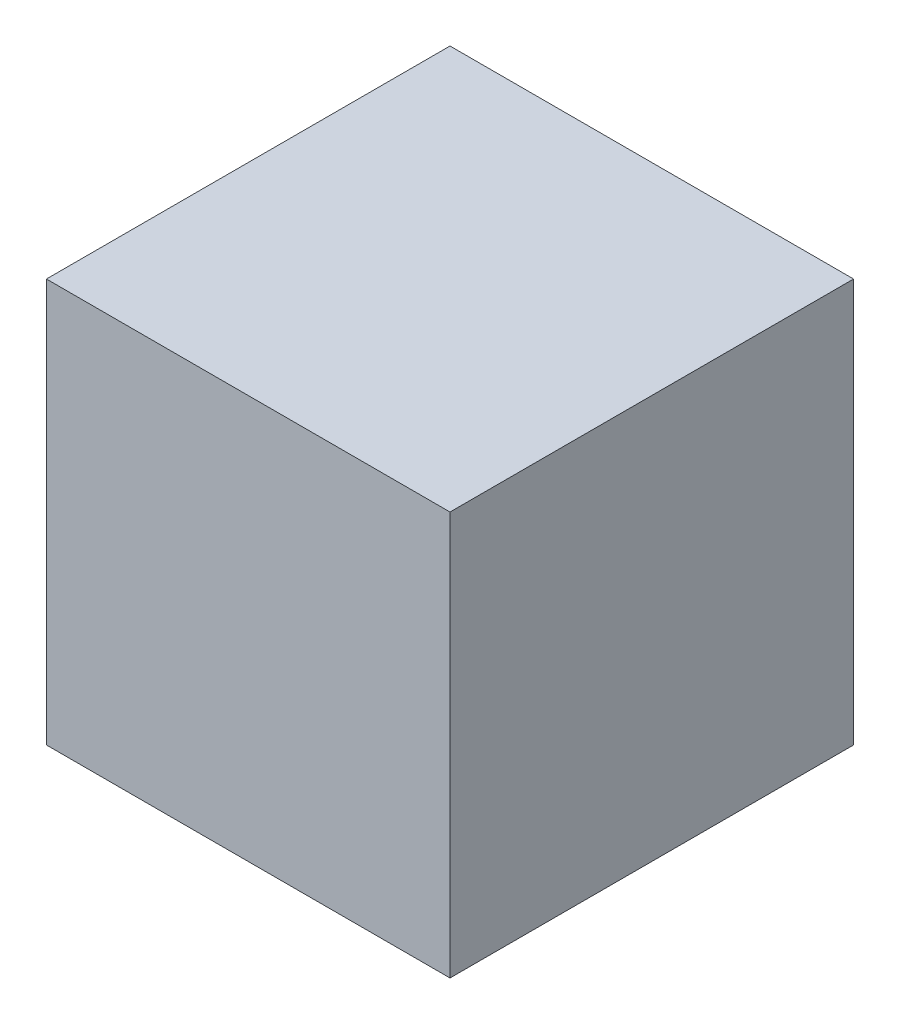
ISO-10303-21;
HEADER;
FILE_DESCRIPTION(('STEP AP214'),'2;1');
FILE_NAME('part.step','',(''),(''),'','','');
FILE_SCHEMA(('AUTOMOTIVE_DESIGN { 1 0 10303 214 1 1 1 1 }'));
ENDSEC;
DATA;
#1=APPLICATION_CONTEXT('core data for automotive mechanical design processes');
#2=APPLICATION_PROTOCOL_DEFINITION('international standard','automotive_design',2000,#1);
#3=PRODUCT_CONTEXT('',#1,'mechanical');
#4=PRODUCT('Part','Part','',(#3));
#5=PRODUCT_RELATED_PRODUCT_CATEGORY('part','',(#4));
#6=PRODUCT_DEFINITION_FORMATION('','',#4);
#7=PRODUCT_DEFINITION_CONTEXT('part definition',#1,'design');
#8=PRODUCT_DEFINITION('design','',#6,#7);
#9=PRODUCT_DEFINITION_SHAPE('','',#8);
#10=(LENGTH_UNIT() NAMED_UNIT(*) SI_UNIT(.MILLI.,.METRE.));
#11=(NAMED_UNIT(*) PLANE_ANGLE_UNIT() SI_UNIT($,.RADIAN.));
#12=(NAMED_UNIT(*) SI_UNIT($,.STERADIAN.) SOLID_ANGLE_UNIT());
#13=UNCERTAINTY_MEASURE_WITH_UNIT(LENGTH_MEASURE(1.E-05),#10,'distance_accuracy_value','');
#14=(GEOMETRIC_REPRESENTATION_CONTEXT(3) GLOBAL_UNCERTAINTY_ASSIGNED_CONTEXT((#13)) GLOBAL_UNIT_ASSIGNED_CONTEXT((#10,
#11,#12)) REPRESENTATION_CONTEXT('',''));
#15=CARTESIAN_POINT('',(0.,0.,0.));
#16=DIRECTION('',(0.,0.,1.));
#17=DIRECTION('',(1.,0.,0.));
#18=AXIS2_PLACEMENT_3D('',#15,#16,#17);
#19=CARTESIAN_POINT('',(-15.,30.,-15.));
#20=DIRECTION('',(1.,0.,0.));
#21=DIRECTION('',(0.,0.,-1.));
#22=AXIS2_PLACEMENT_3D('',#19,#20,#21);
#23=PLANE('',#22);
#24=CARTESIAN_POINT('',(-15.,15.,0.));
#25=DIRECTION('',(1.,0.,0.));
#26=DIRECTION('',(0.,0.,-1.));
#27=AXIS2_PLACEMENT_3D('',#24,#25,#26);
#28=CIRCLE('',#27,5.1234753829798);
#29=CARTESIAN_POINT('',(-15.,15.,-5.1234753829798));
#30=VERTEX_POINT('',#29);
#31=EDGE_CURVE('E11',#30,#30,#28,.F.);
#32=ORIENTED_EDGE('',*,*,#31,.F.);
#33=EDGE_LOOP('',(#32));
#34=FACE_BOUND('',#33,.T.);
#35=DIRECTION('',(0.,0.,1.));
#36=VECTOR('',#35,1.);
#37=CARTESIAN_POINT('',(-15.,0.,-15.));
#38=LINE('',#37,#36);
#39=CARTESIAN_POINT('',(-15.,0.,-15.));
#40=VERTEX_POINT('',#39);
#41=CARTESIAN_POINT('',(-15.,0.,15.));
#42=VERTEX_POINT('',#41);
#43=EDGE_CURVE('E99',#40,#42,#38,.T.);
#44=ORIENTED_EDGE('',*,*,#43,.T.);
#45=DIRECTION('',(0.,-1.,0.));
#46=VECTOR('',#45,1.);
#47=CARTESIAN_POINT('',(-15.,30.,15.));
#48=LINE('',#47,#46);
#49=CARTESIAN_POINT('',(-15.,30.,15.));
#50=VERTEX_POINT('',#49);
#51=EDGE_CURVE('E41',#50,#42,#48,.T.);
#52=ORIENTED_EDGE('',*,*,#51,.F.);
#53=DIRECTION('',(0.,0.,1.));
#54=VECTOR('',#53,1.);
#55=CARTESIAN_POINT('',(-15.,30.,-15.));
#56=LINE('',#55,#54);
#57=CARTESIAN_POINT('',(-15.,30.,-15.));
#58=VERTEX_POINT('',#57);
#59=EDGE_CURVE('E85',#58,#50,#56,.T.);
#60=ORIENTED_EDGE('',*,*,#59,.F.);
#61=DIRECTION('',(0.,-1.,0.));
#62=VECTOR('',#61,1.);
#63=CARTESIAN_POINT('',(-15.,30.,-15.));
#64=LINE('',#63,#62);
#65=EDGE_CURVE('E95',#58,#40,#64,.T.);
#66=ORIENTED_EDGE('',*,*,#65,.T.);
#67=EDGE_LOOP('',(#44,#52,#60,#66));
#68=FACE_BOUND('',#67,.T.);
#69=ADVANCED_FACE('F33',(#34,#68),#23,.F.);
#70=CARTESIAN_POINT('',(-15.,30.,15.));
#71=DIRECTION('',(0.,0.,-1.));
#72=DIRECTION('',(-1.,0.,0.));
#73=AXIS2_PLACEMENT_3D('',#70,#71,#72);
#74=PLANE('',#73);
#75=DIRECTION('',(1.,0.,0.));
#76=VECTOR('',#75,1.);
#77=CARTESIAN_POINT('',(-15.,0.,15.));
#78=LINE('',#77,#76);
#79=CARTESIAN_POINT('',(15.,0.,15.));
#80=VERTEX_POINT('',#79);
#81=EDGE_CURVE('E90',#42,#80,#78,.T.);
#82=ORIENTED_EDGE('',*,*,#81,.T.);
#83=DIRECTION('',(0.,-1.,0.));
#84=VECTOR('',#83,1.);
#85=CARTESIAN_POINT('',(15.,30.,15.));
#86=LINE('',#85,#84);
#87=CARTESIAN_POINT('',(15.,30.,15.));
#88=VERTEX_POINT('',#87);
#89=EDGE_CURVE('E88',#88,#80,#86,.T.);
#90=ORIENTED_EDGE('',*,*,#89,.F.);
#91=DIRECTION('',(1.,0.,0.));
#92=VECTOR('',#91,1.);
#93=CARTESIAN_POINT('',(-15.,30.,15.));
#94=LINE('',#93,#92);
#95=EDGE_CURVE('E80',#50,#88,#94,.T.);
#96=ORIENTED_EDGE('',*,*,#95,.F.);
#97=ORIENTED_EDGE('',*,*,#51,.T.);
#98=EDGE_LOOP('',(#82,#90,#96,#97));
#99=FACE_BOUND('',#98,.T.);
#100=ADVANCED_FACE('F89',(#99),#74,.F.);
#101=CARTESIAN_POINT('',(15.,30.,-15.));
#102=DIRECTION('',(-1.,0.,0.));
#103=DIRECTION('',(0.,0.,1.));
#104=AXIS2_PLACEMENT_3D('',#101,#102,#103);
#105=PLANE('',#104);
#106=DIRECTION('',(0.,0.,-1.));
#107=VECTOR('',#106,1.);
#108=CARTESIAN_POINT('',(15.,0.,-15.));
#109=LINE('',#108,#107);
#110=CARTESIAN_POINT('',(15.,0.,-15.));
#111=VERTEX_POINT('',#110);
#112=EDGE_CURVE('E66',#80,#111,#109,.T.);
#113=ORIENTED_EDGE('',*,*,#112,.T.);
#114=DIRECTION('',(0.,-1.,0.));
#115=VECTOR('',#114,1.);
#116=CARTESIAN_POINT('',(15.,30.,-15.));
#117=LINE('',#116,#115);
#118=CARTESIAN_POINT('',(15.,30.,-15.));
#119=VERTEX_POINT('',#118);
#120=EDGE_CURVE('E91',#119,#111,#117,.T.);
#121=ORIENTED_EDGE('',*,*,#120,.F.);
#122=DIRECTION('',(0.,0.,-1.));
#123=VECTOR('',#122,1.);
#124=CARTESIAN_POINT('',(15.,30.,-15.));
#125=LINE('',#124,#123);
#126=EDGE_CURVE('E83',#88,#119,#125,.T.);
#127=ORIENTED_EDGE('',*,*,#126,.F.);
#128=ORIENTED_EDGE('',*,*,#89,.T.);
#129=EDGE_LOOP('',(#113,#121,#127,#128));
#130=FACE_BOUND('',#129,.T.);
#131=ADVANCED_FACE('F93',(#130),#105,.F.);
#132=CARTESIAN_POINT('',(-15.,30.,-15.));
#133=DIRECTION('',(0.,0.,1.));
#134=DIRECTION('',(1.,0.,0.));
#135=AXIS2_PLACEMENT_3D('',#132,#133,#134);
#136=PLANE('',#135);
#137=DIRECTION('',(-1.,0.,0.));
#138=VECTOR('',#137,1.);
#139=CARTESIAN_POINT('',(-15.,0.,-15.));
#140=LINE('',#139,#138);
#141=EDGE_CURVE('E72',#111,#40,#140,.T.);
#142=ORIENTED_EDGE('',*,*,#141,.T.);
#143=ORIENTED_EDGE('',*,*,#65,.F.);
#144=DIRECTION('',(-1.,0.,0.));
#145=VECTOR('',#144,1.);
#146=CARTESIAN_POINT('',(-15.,30.,-15.));
#147=LINE('',#146,#145);
#148=EDGE_CURVE('E49',#119,#58,#147,.T.);
#149=ORIENTED_EDGE('',*,*,#148,.F.);
#150=ORIENTED_EDGE('',*,*,#120,.T.);
#151=EDGE_LOOP('',(#142,#143,#149,#150));
#152=FACE_BOUND('',#151,.T.);
#153=ADVANCED_FACE('F119',(#152),#136,.F.);
#154=CARTESIAN_POINT('',(0.,30.,0.));
#155=DIRECTION('',(0.,1.,0.));
#156=DIRECTION('',(0.,0.,1.));
#157=AXIS2_PLACEMENT_3D('',#154,#155,#156);
#158=PLANE('',#157);
#159=ORIENTED_EDGE('',*,*,#59,.T.);
#160=ORIENTED_EDGE('',*,*,#95,.T.);
#161=ORIENTED_EDGE('',*,*,#126,.T.);
#162=ORIENTED_EDGE('',*,*,#148,.T.);
#163=EDGE_LOOP('',(#159,#160,#161,#162));
#164=FACE_BOUND('',#163,.T.);
#165=ADVANCED_FACE('F81',(#164),#158,.T.);
#166=CARTESIAN_POINT('',(0.,0.,0.));
#167=DIRECTION('',(0.,1.,0.));
#168=DIRECTION('',(0.,0.,1.));
#169=AXIS2_PLACEMENT_3D('',#166,#167,#168);
#170=PLANE('',#169);
#171=ORIENTED_EDGE('',*,*,#43,.F.);
#172=ORIENTED_EDGE('',*,*,#141,.F.);
#173=ORIENTED_EDGE('',*,*,#112,.F.);
#174=ORIENTED_EDGE('',*,*,#81,.F.);
#175=EDGE_LOOP('',(#171,#172,#173,#174));
#176=FACE_BOUND('',#175,.T.);
#177=ADVANCED_FACE('F109',(#176),#170,.F.);
#178=CARTESIAN_POINT('',(-11.,15.,0.));
#179=DIRECTION('',(-1.,0.,0.));
#180=DIRECTION('',(0.,1.,0.));
#181=AXIS2_PLACEMENT_3D('',#178,#179,#180);
#182=SPHERICAL_SURFACE('',#181,6.5);
#183=ORIENTED_EDGE('',*,*,#31,.T.);
#184=EDGE_LOOP('',(#183));
#185=FACE_BOUND('',#184,.T.);
#186=ADVANCED_FACE('F111',(#185),#182,.T.);
#187=CLOSED_SHELL('',(#69,#100,#131,#153,#165,#177,#186));
#188=MANIFOLD_SOLID_BREP('B2',#187);
#189=ADVANCED_BREP_SHAPE_REPRESENTATION('',(#18,#188),#14);
#190=SHAPE_DEFINITION_REPRESENTATION(#9,#189);
ENDSEC;
END-ISO-10303-21;
